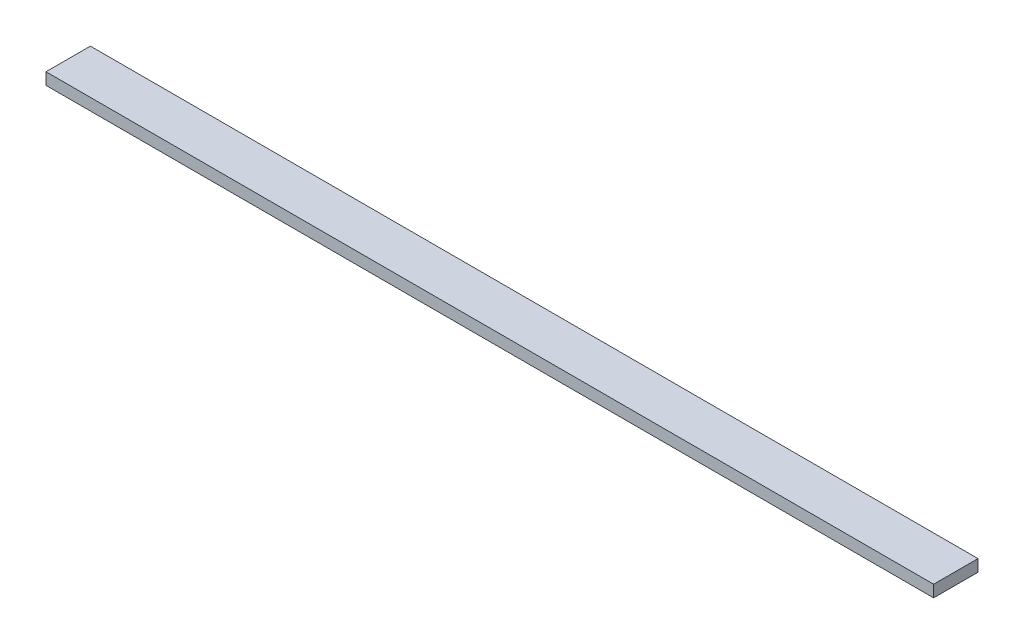
ISO-10303-21;
HEADER;
FILE_DESCRIPTION(('STEP AP214'),'2;1');
FILE_NAME('part.step','',(''),(''),'','','');
FILE_SCHEMA(('AUTOMOTIVE_DESIGN { 1 0 10303 214 1 1 1 1 }'));
ENDSEC;
DATA;
#1=APPLICATION_CONTEXT('core data for automotive mechanical design processes');
#2=APPLICATION_PROTOCOL_DEFINITION('international standard','automotive_design',2000,#1);
#3=PRODUCT_CONTEXT('',#1,'mechanical');
#4=PRODUCT('Part','Part','',(#3));
#5=PRODUCT_RELATED_PRODUCT_CATEGORY('part','',(#4));
#6=PRODUCT_DEFINITION_FORMATION('','',#4);
#7=PRODUCT_DEFINITION_CONTEXT('part definition',#1,'design');
#8=PRODUCT_DEFINITION('design','',#6,#7);
#9=PRODUCT_DEFINITION_SHAPE('','',#8);
#10=(LENGTH_UNIT() NAMED_UNIT(*) SI_UNIT(.MILLI.,.METRE.));
#11=(NAMED_UNIT(*) PLANE_ANGLE_UNIT() SI_UNIT($,.RADIAN.));
#12=(NAMED_UNIT(*) SI_UNIT($,.STERADIAN.) SOLID_ANGLE_UNIT());
#13=UNCERTAINTY_MEASURE_WITH_UNIT(LENGTH_MEASURE(1.E-05),#10,'distance_accuracy_value','');
#14=(GEOMETRIC_REPRESENTATION_CONTEXT(3) GLOBAL_UNCERTAINTY_ASSIGNED_CONTEXT((#13)) GLOBAL_UNIT_ASSIGNED_CONTEXT((#10,
#11,#12)) REPRESENTATION_CONTEXT('',''));
#15=CARTESIAN_POINT('',(0.,0.,0.));
#16=DIRECTION('',(0.,0.,1.));
#17=DIRECTION('',(1.,0.,0.));
#18=AXIS2_PLACEMENT_3D('',#15,#16,#17);
#19=CARTESIAN_POINT('',(300.,8.,-15.));
#20=DIRECTION('',(-1.,0.,0.));
#21=DIRECTION('',(0.,0.,1.));
#22=AXIS2_PLACEMENT_3D('',#19,#20,#21);
#23=PLANE('',#22);
#24=DIRECTION('',(0.,0.,-1.));
#25=VECTOR('',#24,1.);
#26=CARTESIAN_POINT('',(300.,0.,-15.));
#27=LINE('',#26,#25);
#28=CARTESIAN_POINT('',(300.,0.,15.));
#29=VERTEX_POINT('',#28);
#30=CARTESIAN_POINT('',(300.,0.,-15.));
#31=VERTEX_POINT('',#30);
#32=EDGE_CURVE('E100',#29,#31,#27,.T.);
#33=ORIENTED_EDGE('',*,*,#32,.T.);
#34=DIRECTION('',(0.,-1.,0.));
#35=VECTOR('',#34,1.);
#36=CARTESIAN_POINT('',(300.,8.,-15.));
#37=LINE('',#36,#35);
#38=CARTESIAN_POINT('',(300.,8.,-15.));
#39=VERTEX_POINT('',#38);
#40=EDGE_CURVE('E11',#39,#31,#37,.T.);
#41=ORIENTED_EDGE('',*,*,#40,.F.);
#42=DIRECTION('',(0.,0.,-1.));
#43=VECTOR('',#42,1.);
#44=CARTESIAN_POINT('',(300.,8.,-15.));
#45=LINE('',#44,#43);
#46=CARTESIAN_POINT('',(300.,8.,15.));
#47=VERTEX_POINT('',#46);
#48=EDGE_CURVE('E88',#47,#39,#45,.T.);
#49=ORIENTED_EDGE('',*,*,#48,.F.);
#50=DIRECTION('',(0.,-1.,0.));
#51=VECTOR('',#50,1.);
#52=CARTESIAN_POINT('',(300.,8.,15.));
#53=LINE('',#52,#51);
#54=EDGE_CURVE('E96',#47,#29,#53,.T.);
#55=ORIENTED_EDGE('',*,*,#54,.T.);
#56=EDGE_LOOP('',(#33,#41,#49,#55));
#57=FACE_BOUND('',#56,.T.);
#58=ADVANCED_FACE('F37',(#57),#23,.F.);
#59=CARTESIAN_POINT('',(-300.,8.,-15.));
#60=DIRECTION('',(0.,0.,1.));
#61=DIRECTION('',(1.,0.,0.));
#62=AXIS2_PLACEMENT_3D('',#59,#60,#61);
#63=PLANE('',#62);
#64=DIRECTION('',(-1.,0.,0.));
#65=VECTOR('',#64,1.);
#66=CARTESIAN_POINT('',(-300.,0.,-15.));
#67=LINE('',#66,#65);
#68=CARTESIAN_POINT('',(-300.,0.,-15.));
#69=VERTEX_POINT('',#68);
#70=EDGE_CURVE('E92',#31,#69,#67,.T.);
#71=ORIENTED_EDGE('',*,*,#70,.T.);
#72=DIRECTION('',(0.,-1.,0.));
#73=VECTOR('',#72,1.);
#74=CARTESIAN_POINT('',(-300.,8.,-15.));
#75=LINE('',#74,#73);
#76=CARTESIAN_POINT('',(-300.,8.,-15.));
#77=VERTEX_POINT('',#76);
#78=EDGE_CURVE('E45',#77,#69,#75,.T.);
#79=ORIENTED_EDGE('',*,*,#78,.F.);
#80=DIRECTION('',(-1.,0.,0.));
#81=VECTOR('',#80,1.);
#82=CARTESIAN_POINT('',(-300.,8.,-15.));
#83=LINE('',#82,#81);
#84=EDGE_CURVE('E83',#39,#77,#83,.T.);
#85=ORIENTED_EDGE('',*,*,#84,.F.);
#86=ORIENTED_EDGE('',*,*,#40,.T.);
#87=EDGE_LOOP('',(#71,#79,#85,#86));
#88=FACE_BOUND('',#87,.T.);
#89=ADVANCED_FACE('F91',(#88),#63,.F.);
#90=CARTESIAN_POINT('',(-300.,8.,-15.));
#91=DIRECTION('',(1.,0.,0.));
#92=DIRECTION('',(0.,0.,-1.));
#93=AXIS2_PLACEMENT_3D('',#90,#91,#92);
#94=PLANE('',#93);
#95=DIRECTION('',(0.,0.,1.));
#96=VECTOR('',#95,1.);
#97=CARTESIAN_POINT('',(-300.,0.,-15.));
#98=LINE('',#97,#96);
#99=CARTESIAN_POINT('',(-300.,0.,15.));
#100=VERTEX_POINT('',#99);
#101=EDGE_CURVE('E70',#69,#100,#98,.T.);
#102=ORIENTED_EDGE('',*,*,#101,.T.);
#103=DIRECTION('',(0.,-1.,0.));
#104=VECTOR('',#103,1.);
#105=CARTESIAN_POINT('',(-300.,8.,15.));
#106=LINE('',#105,#104);
#107=CARTESIAN_POINT('',(-300.,8.,15.));
#108=VERTEX_POINT('',#107);
#109=EDGE_CURVE('E93',#108,#100,#106,.T.);
#110=ORIENTED_EDGE('',*,*,#109,.F.);
#111=DIRECTION('',(0.,0.,1.));
#112=VECTOR('',#111,1.);
#113=CARTESIAN_POINT('',(-300.,8.,-15.));
#114=LINE('',#113,#112);
#115=EDGE_CURVE('E86',#77,#108,#114,.T.);
#116=ORIENTED_EDGE('',*,*,#115,.F.);
#117=ORIENTED_EDGE('',*,*,#78,.T.);
#118=EDGE_LOOP('',(#102,#110,#116,#117));
#119=FACE_BOUND('',#118,.T.);
#120=ADVANCED_FACE('F94',(#119),#94,.F.);
#121=CARTESIAN_POINT('',(-300.,8.,15.));
#122=DIRECTION('',(0.,0.,-1.));
#123=DIRECTION('',(-1.,0.,0.));
#124=AXIS2_PLACEMENT_3D('',#121,#122,#123);
#125=PLANE('',#124);
#126=DIRECTION('',(1.,0.,0.));
#127=VECTOR('',#126,1.);
#128=CARTESIAN_POINT('',(-300.,0.,15.));
#129=LINE('',#128,#127);
#130=EDGE_CURVE('E76',#100,#29,#129,.T.);
#131=ORIENTED_EDGE('',*,*,#130,.T.);
#132=ORIENTED_EDGE('',*,*,#54,.F.);
#133=DIRECTION('',(1.,0.,0.));
#134=VECTOR('',#133,1.);
#135=CARTESIAN_POINT('',(-300.,8.,15.));
#136=LINE('',#135,#134);
#137=EDGE_CURVE('E53',#108,#47,#136,.T.);
#138=ORIENTED_EDGE('',*,*,#137,.F.);
#139=ORIENTED_EDGE('',*,*,#109,.T.);
#140=EDGE_LOOP('',(#131,#132,#138,#139));
#141=FACE_BOUND('',#140,.T.);
#142=ADVANCED_FACE('F107',(#141),#125,.F.);
#143=CARTESIAN_POINT('',(0.,8.,0.));
#144=DIRECTION('',(0.,1.,0.));
#145=DIRECTION('',(0.,0.,1.));
#146=AXIS2_PLACEMENT_3D('',#143,#144,#145);
#147=PLANE('',#146);
#148=ORIENTED_EDGE('',*,*,#48,.T.);
#149=ORIENTED_EDGE('',*,*,#84,.T.);
#150=ORIENTED_EDGE('',*,*,#115,.T.);
#151=ORIENTED_EDGE('',*,*,#137,.T.);
#152=EDGE_LOOP('',(#148,#149,#150,#151));
#153=FACE_BOUND('',#152,.T.);
#154=ADVANCED_FACE('F84',(#153),#147,.T.);
#155=CARTESIAN_POINT('',(0.,0.,0.));
#156=DIRECTION('',(0.,1.,0.));
#157=DIRECTION('',(0.,0.,1.));
#158=AXIS2_PLACEMENT_3D('',#155,#156,#157);
#159=PLANE('',#158);
#160=ORIENTED_EDGE('',*,*,#32,.F.);
#161=ORIENTED_EDGE('',*,*,#130,.F.);
#162=ORIENTED_EDGE('',*,*,#101,.F.);
#163=ORIENTED_EDGE('',*,*,#70,.F.);
#164=EDGE_LOOP('',(#160,#161,#162,#163));
#165=FACE_BOUND('',#164,.T.);
#166=ADVANCED_FACE('F110',(#165),#159,.F.);
#167=CLOSED_SHELL('',(#58,#89,#120,#142,#154,#166));
#168=MANIFOLD_SOLID_BREP('B2',#167);
#169=ADVANCED_BREP_SHAPE_REPRESENTATION('',(#18,#168),#14);
#170=SHAPE_DEFINITION_REPRESENTATION(#9,#169);
ENDSEC;
END-ISO-10303-21;
